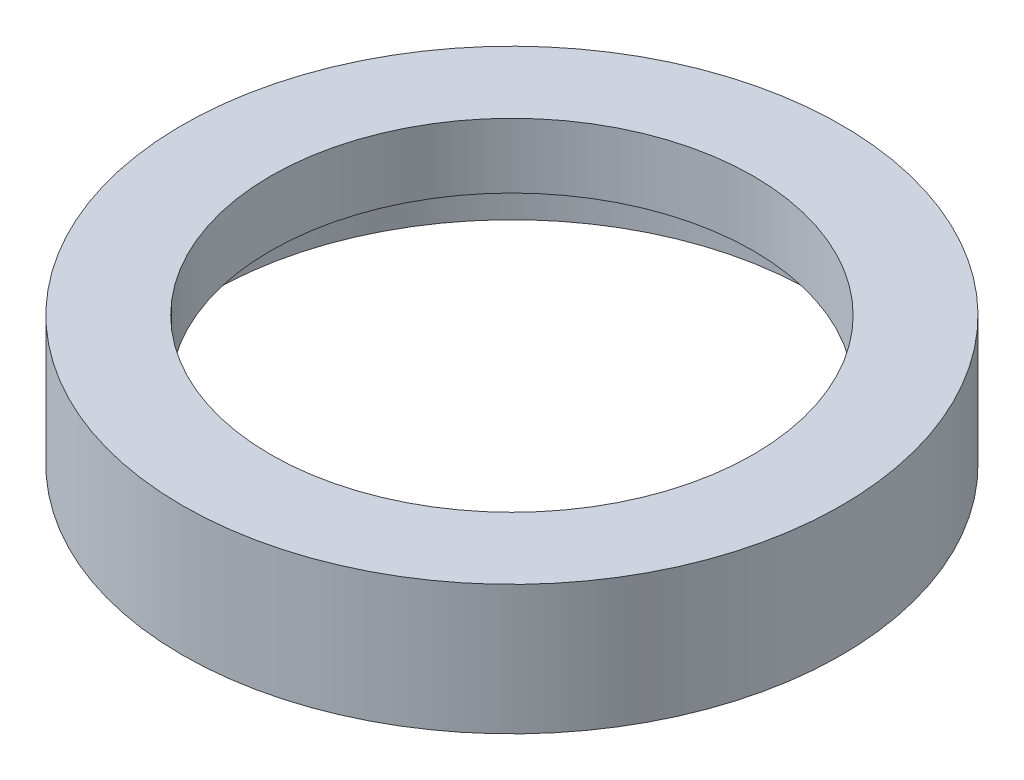
ISO-10303-21;
HEADER;
FILE_DESCRIPTION(('STEP AP214'),'2;1');
FILE_NAME('part.step','',(''),(''),'','','');
FILE_SCHEMA(('AUTOMOTIVE_DESIGN { 1 0 10303 214 1 1 1 1 }'));
ENDSEC;
DATA;
#1=APPLICATION_CONTEXT('core data for automotive mechanical design processes');
#2=APPLICATION_PROTOCOL_DEFINITION('international standard','automotive_design',2000,#1);
#3=PRODUCT_CONTEXT('',#1,'mechanical');
#4=PRODUCT('Part','Part','',(#3));
#5=PRODUCT_RELATED_PRODUCT_CATEGORY('part','',(#4));
#6=PRODUCT_DEFINITION_FORMATION('','',#4);
#7=PRODUCT_DEFINITION_CONTEXT('part definition',#1,'design');
#8=PRODUCT_DEFINITION('design','',#6,#7);
#9=PRODUCT_DEFINITION_SHAPE('','',#8);
#10=(LENGTH_UNIT() NAMED_UNIT(*) SI_UNIT(.MILLI.,.METRE.));
#11=(NAMED_UNIT(*) PLANE_ANGLE_UNIT() SI_UNIT($,.RADIAN.));
#12=(NAMED_UNIT(*) SI_UNIT($,.STERADIAN.) SOLID_ANGLE_UNIT());
#13=UNCERTAINTY_MEASURE_WITH_UNIT(LENGTH_MEASURE(1.E-05),#10,'distance_accuracy_value','');
#14=(GEOMETRIC_REPRESENTATION_CONTEXT(3) GLOBAL_UNCERTAINTY_ASSIGNED_CONTEXT((#13)) GLOBAL_UNIT_ASSIGNED_CONTEXT((#10,
#11,#12)) REPRESENTATION_CONTEXT('',''));
#15=CARTESIAN_POINT('',(0.,0.,0.));
#16=DIRECTION('',(0.,0.,1.));
#17=DIRECTION('',(1.,0.,0.));
#18=AXIS2_PLACEMENT_3D('',#15,#16,#17);
#19=CARTESIAN_POINT('',(28.,0.,0.));
#20=DIRECTION('',(0.,1.,0.));
#21=DIRECTION('',(0.,0.,1.));
#22=AXIS2_PLACEMENT_3D('',#19,#20,#21);
#23=PLANE('',#22);
#24=CARTESIAN_POINT('',(0.,0.,0.));
#25=DIRECTION('',(0.,1.,0.));
#26=DIRECTION('',(0.,0.,1.));
#27=AXIS2_PLACEMENT_3D('',#24,#25,#26);
#28=CIRCLE('',#27,28.);
#29=CARTESIAN_POINT('',(0.,0.,28.));
#30=VERTEX_POINT('',#29);
#31=EDGE_CURVE('E63',#30,#30,#28,.T.);
#32=ORIENTED_EDGE('',*,*,#31,.F.);
#33=EDGE_LOOP('',(#32));
#34=FACE_BOUND('',#33,.T.);
#35=CARTESIAN_POINT('',(0.,0.,0.));
#36=DIRECTION('',(0.,1.,0.));
#37=DIRECTION('',(0.,0.,1.));
#38=AXIS2_PLACEMENT_3D('',#35,#36,#37);
#39=CIRCLE('',#38,25.5);
#40=CARTESIAN_POINT('',(0.,0.,25.5));
#41=VERTEX_POINT('',#40);
#42=EDGE_CURVE('E10',#41,#41,#39,.T.);
#43=ORIENTED_EDGE('',*,*,#42,.T.);
#44=EDGE_LOOP('',(#43));
#45=FACE_BOUND('',#44,.T.);
#46=ADVANCED_FACE('F35',(#34,#45),#23,.F.);
#47=CARTESIAN_POINT('',(0.,60.0208204142554,0.));
#48=DIRECTION('',(0.,1.,0.));
#49=DIRECTION('',(0.,0.,1.));
#50=AXIS2_PLACEMENT_3D('',#47,#48,#49);
#51=CYLINDRICAL_SURFACE('',#50,25.5);
#52=ORIENTED_EDGE('',*,*,#42,.F.);
#53=EDGE_LOOP('',(#52));
#54=FACE_BOUND('',#53,.T.);
#55=CARTESIAN_POINT('',(0.,4.5,0.));
#56=DIRECTION('',(0.,1.,0.));
#57=DIRECTION('',(0.,0.,1.));
#58=AXIS2_PLACEMENT_3D('',#55,#56,#57);
#59=CIRCLE('',#58,25.5);
#60=CARTESIAN_POINT('',(0.,4.5,25.5));
#61=VERTEX_POINT('',#60);
#62=EDGE_CURVE('E41',#61,#61,#59,.T.);
#63=ORIENTED_EDGE('',*,*,#62,.T.);
#64=EDGE_LOOP('',(#63));
#65=FACE_BOUND('',#64,.T.);
#66=ADVANCED_FACE('F70',(#54,#65),#51,.F.);
#67=CARTESIAN_POINT('',(25.5,4.5,0.));
#68=DIRECTION('',(0.,-1.,0.));
#69=DIRECTION('',(0.,0.,-1.));
#70=AXIS2_PLACEMENT_3D('',#67,#68,#69);
#71=PLANE('',#70);
#72=ORIENTED_EDGE('',*,*,#62,.F.);
#73=EDGE_LOOP('',(#72));
#74=FACE_BOUND('',#73,.T.);
#75=CARTESIAN_POINT('',(0.,4.5,0.));
#76=DIRECTION('',(0.,1.,0.));
#77=DIRECTION('',(0.,0.,1.));
#78=AXIS2_PLACEMENT_3D('',#75,#76,#77);
#79=CIRCLE('',#78,26.1);
#80=CARTESIAN_POINT('',(0.,4.5,26.1));
#81=VERTEX_POINT('',#80);
#82=EDGE_CURVE('E45',#81,#81,#79,.T.);
#83=ORIENTED_EDGE('',*,*,#82,.T.);
#84=EDGE_LOOP('',(#83));
#85=FACE_BOUND('',#84,.T.);
#86=ADVANCED_FACE('F74',(#74,#85),#71,.F.);
#87=CARTESIAN_POINT('',(0.,60.0208204142554,0.));
#88=DIRECTION('',(0.,1.,0.));
#89=DIRECTION('',(0.,0.,1.));
#90=AXIS2_PLACEMENT_3D('',#87,#88,#89);
#91=CYLINDRICAL_SURFACE('',#90,26.1);
#92=ORIENTED_EDGE('',*,*,#82,.F.);
#93=EDGE_LOOP('',(#92));
#94=FACE_BOUND('',#93,.T.);
#95=CARTESIAN_POINT('',(0.,5.5,0.));
#96=DIRECTION('',(0.,1.,0.));
#97=DIRECTION('',(0.,0.,1.));
#98=AXIS2_PLACEMENT_3D('',#95,#96,#97);
#99=CIRCLE('',#98,26.1);
#100=CARTESIAN_POINT('',(0.,5.5,26.1));
#101=VERTEX_POINT('',#100);
#102=EDGE_CURVE('E49',#101,#101,#99,.T.);
#103=ORIENTED_EDGE('',*,*,#102,.T.);
#104=EDGE_LOOP('',(#103));
#105=FACE_BOUND('',#104,.T.);
#106=ADVANCED_FACE('F79',(#94,#105),#91,.F.);
#107=CARTESIAN_POINT('',(26.1,5.5,0.));
#108=DIRECTION('',(0.,1.,0.));
#109=DIRECTION('',(0.,0.,1.));
#110=AXIS2_PLACEMENT_3D('',#107,#108,#109);
#111=PLANE('',#110);
#112=ORIENTED_EDGE('',*,*,#102,.F.);
#113=EDGE_LOOP('',(#112));
#114=FACE_BOUND('',#113,.T.);
#115=CARTESIAN_POINT('',(0.,5.5,0.));
#116=DIRECTION('',(0.,1.,0.));
#117=DIRECTION('',(0.,0.,1.));
#118=AXIS2_PLACEMENT_3D('',#115,#116,#117);
#119=CIRCLE('',#118,20.5);
#120=CARTESIAN_POINT('',(0.,5.5,20.5));
#121=VERTEX_POINT('',#120);
#122=EDGE_CURVE('E54',#121,#121,#119,.T.);
#123=ORIENTED_EDGE('',*,*,#122,.T.);
#124=EDGE_LOOP('',(#123));
#125=FACE_BOUND('',#124,.T.);
#126=ADVANCED_FACE('F85',(#114,#125),#111,.F.);
#127=CARTESIAN_POINT('',(0.,60.0208204142554,0.));
#128=DIRECTION('',(0.,1.,0.));
#129=DIRECTION('',(0.,0.,1.));
#130=AXIS2_PLACEMENT_3D('',#127,#128,#129);
#131=CYLINDRICAL_SURFACE('',#130,20.5);
#132=ORIENTED_EDGE('',*,*,#122,.F.);
#133=EDGE_LOOP('',(#132));
#134=FACE_BOUND('',#133,.T.);
#135=CARTESIAN_POINT('',(0.,11.,0.));
#136=DIRECTION('',(0.,1.,0.));
#137=DIRECTION('',(0.,0.,1.));
#138=AXIS2_PLACEMENT_3D('',#135,#136,#137);
#139=CIRCLE('',#138,20.5);
#140=CARTESIAN_POINT('',(0.,11.,20.5));
#141=VERTEX_POINT('',#140);
#142=EDGE_CURVE('E57',#141,#141,#139,.T.);
#143=ORIENTED_EDGE('',*,*,#142,.T.);
#144=EDGE_LOOP('',(#143));
#145=FACE_BOUND('',#144,.T.);
#146=ADVANCED_FACE('F89',(#134,#145),#131,.F.);
#147=CARTESIAN_POINT('',(20.5,11.,0.));
#148=DIRECTION('',(0.,-1.,0.));
#149=DIRECTION('',(0.,0.,-1.));
#150=AXIS2_PLACEMENT_3D('',#147,#148,#149);
#151=PLANE('',#150);
#152=ORIENTED_EDGE('',*,*,#142,.F.);
#153=EDGE_LOOP('',(#152));
#154=FACE_BOUND('',#153,.T.);
#155=CARTESIAN_POINT('',(0.,11.,0.));
#156=DIRECTION('',(0.,1.,0.));
#157=DIRECTION('',(0.,0.,1.));
#158=AXIS2_PLACEMENT_3D('',#155,#156,#157);
#159=CIRCLE('',#158,28.);
#160=CARTESIAN_POINT('',(0.,11.,28.));
#161=VERTEX_POINT('',#160);
#162=EDGE_CURVE('E60',#161,#161,#159,.T.);
#163=ORIENTED_EDGE('',*,*,#162,.T.);
#164=EDGE_LOOP('',(#163));
#165=FACE_BOUND('',#164,.T.);
#166=ADVANCED_FACE('F93',(#154,#165),#151,.F.);
#167=CARTESIAN_POINT('',(0.,60.0208204142554,0.));
#168=DIRECTION('',(0.,1.,0.));
#169=DIRECTION('',(0.,0.,1.));
#170=AXIS2_PLACEMENT_3D('',#167,#168,#169);
#171=CYLINDRICAL_SURFACE('',#170,28.);
#172=ORIENTED_EDGE('',*,*,#162,.F.);
#173=EDGE_LOOP('',(#172));
#174=FACE_BOUND('',#173,.T.);
#175=ORIENTED_EDGE('',*,*,#31,.T.);
#176=EDGE_LOOP('',(#175));
#177=FACE_BOUND('',#176,.T.);
#178=ADVANCED_FACE('F67',(#174,#177),#171,.T.);
#179=CLOSED_SHELL('',(#46,#66,#86,#106,#126,#146,#166,#178));
#180=MANIFOLD_SOLID_BREP('B2',#179);
#181=ADVANCED_BREP_SHAPE_REPRESENTATION('',(#18,#180),#14);
#182=SHAPE_DEFINITION_REPRESENTATION(#9,#181);
ENDSEC;
END-ISO-10303-21;
